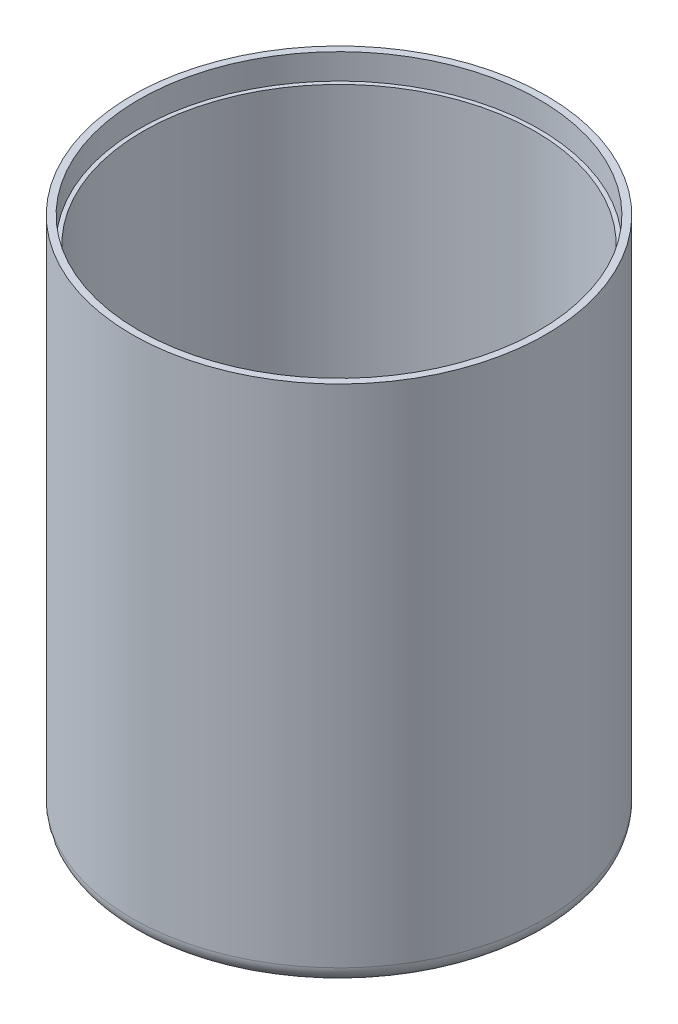
ISO-10303-21;
HEADER;
FILE_DESCRIPTION(('STEP AP214'),'2;1');
FILE_NAME('part.step','',(''),(''),'','','');
FILE_SCHEMA(('AUTOMOTIVE_DESIGN { 1 0 10303 214 1 1 1 1 }'));
ENDSEC;
DATA;
#1=APPLICATION_CONTEXT('core data for automotive mechanical design processes');
#2=APPLICATION_PROTOCOL_DEFINITION('international standard','automotive_design',2000,#1);
#3=PRODUCT_CONTEXT('',#1,'mechanical');
#4=PRODUCT('Part','Part','',(#3));
#5=PRODUCT_RELATED_PRODUCT_CATEGORY('part','',(#4));
#6=PRODUCT_DEFINITION_FORMATION('','',#4);
#7=PRODUCT_DEFINITION_CONTEXT('part definition',#1,'design');
#8=PRODUCT_DEFINITION('design','',#6,#7);
#9=PRODUCT_DEFINITION_SHAPE('','',#8);
#10=(LENGTH_UNIT() NAMED_UNIT(*) SI_UNIT(.MILLI.,.METRE.));
#11=(NAMED_UNIT(*) PLANE_ANGLE_UNIT() SI_UNIT($,.RADIAN.));
#12=(NAMED_UNIT(*) SI_UNIT($,.STERADIAN.) SOLID_ANGLE_UNIT());
#13=UNCERTAINTY_MEASURE_WITH_UNIT(LENGTH_MEASURE(1.E-05),#10,'distance_accuracy_value','');
#14=(GEOMETRIC_REPRESENTATION_CONTEXT(3) GLOBAL_UNCERTAINTY_ASSIGNED_CONTEXT((#13)) GLOBAL_UNIT_ASSIGNED_CONTEXT((#10,
#11,#12)) REPRESENTATION_CONTEXT('',''));
#15=CARTESIAN_POINT('',(0.,0.,0.));
#16=DIRECTION('',(0.,0.,1.));
#17=DIRECTION('',(1.,0.,0.));
#18=AXIS2_PLACEMENT_3D('',#15,#16,#17);
#19=CARTESIAN_POINT('',(0.,-2.28012519124318,0.));
#20=DIRECTION('',(0.,-1.,0.));
#21=DIRECTION('',(0.,0.,-1.));
#22=AXIS2_PLACEMENT_3D('',#19,#20,#21);
#23=CYLINDRICAL_SURFACE('',#22,11.55);
#24=CARTESIAN_POINT('',(0.,0.65,0.));
#25=DIRECTION('',(0.,-1.,0.));
#26=DIRECTION('',(0.,0.,-1.));
#27=AXIS2_PLACEMENT_3D('',#24,#25,#26);
#28=CIRCLE('',#27,11.55);
#29=CARTESIAN_POINT('',(0.,0.65,-11.55));
#30=VERTEX_POINT('',#29);
#31=EDGE_CURVE('E78',#30,#30,#28,.T.);
#32=ORIENTED_EDGE('',*,*,#31,.T.);
#33=EDGE_LOOP('',(#32));
#34=FACE_BOUND('',#33,.T.);
#35=CARTESIAN_POINT('',(0.,29.3,0.));
#36=DIRECTION('',(0.,1.,0.));
#37=DIRECTION('',(0.,0.,1.));
#38=AXIS2_PLACEMENT_3D('',#35,#36,#37);
#39=CIRCLE('',#38,11.55);
#40=CARTESIAN_POINT('',(0.,29.3,11.55));
#41=VERTEX_POINT('',#40);
#42=EDGE_CURVE('E54',#41,#41,#39,.F.);
#43=ORIENTED_EDGE('',*,*,#42,.F.);
#44=EDGE_LOOP('',(#43));
#45=FACE_BOUND('',#44,.T.);
#46=ADVANCED_FACE('F36',(#34,#45),#23,.F.);
#47=CARTESIAN_POINT('',(0.,-2.28012519124318,0.));
#48=DIRECTION('',(0.,-1.,0.));
#49=DIRECTION('',(0.,0.,-1.));
#50=AXIS2_PLACEMENT_3D('',#47,#48,#49);
#51=CYLINDRICAL_SURFACE('',#50,12.2);
#52=CARTESIAN_POINT('',(0.,1.,0.));
#53=DIRECTION('',(0.,-1.,0.));
#54=DIRECTION('',(0.,0.,-1.));
#55=AXIS2_PLACEMENT_3D('',#52,#53,#54);
#56=CIRCLE('',#55,12.2);
#57=CARTESIAN_POINT('',(0.,1.,-12.2));
#58=VERTEX_POINT('',#57);
#59=EDGE_CURVE('E10',#58,#58,#56,.F.);
#60=ORIENTED_EDGE('',*,*,#59,.T.);
#61=EDGE_LOOP('',(#60));
#62=FACE_BOUND('',#61,.T.);
#63=CARTESIAN_POINT('',(0.,30.8,0.));
#64=DIRECTION('',(0.,-1.,0.));
#65=DIRECTION('',(0.,0.,-1.));
#66=AXIS2_PLACEMENT_3D('',#63,#64,#65);
#67=CIRCLE('',#66,12.2);
#68=CARTESIAN_POINT('',(0.,30.8,-12.2));
#69=VERTEX_POINT('',#68);
#70=EDGE_CURVE('E81',#69,#69,#67,.T.);
#71=ORIENTED_EDGE('',*,*,#70,.T.);
#72=EDGE_LOOP('',(#71));
#73=FACE_BOUND('',#72,.T.);
#74=ADVANCED_FACE('F113',(#62,#73),#51,.T.);
#75=CARTESIAN_POINT('',(3.225,0.,0.));
#76=DIRECTION('',(0.,-1.,0.));
#77=DIRECTION('',(0.,0.,-1.));
#78=AXIS2_PLACEMENT_3D('',#75,#76,#77);
#79=PLANE('',#78);
#80=CARTESIAN_POINT('',(0.,0.,0.));
#81=DIRECTION('',(0.,-1.,0.));
#82=DIRECTION('',(0.,0.,-1.));
#83=AXIS2_PLACEMENT_3D('',#80,#81,#82);
#84=CIRCLE('',#83,11.2);
#85=CARTESIAN_POINT('',(0.,0.,-11.2));
#86=VERTEX_POINT('',#85);
#87=EDGE_CURVE('E43',#86,#86,#84,.T.);
#88=ORIENTED_EDGE('',*,*,#87,.T.);
#89=EDGE_LOOP('',(#88));
#90=FACE_BOUND('',#89,.T.);
#91=CARTESIAN_POINT('',(-8.5,0.,0.));
#92=DIRECTION('',(0.,-1.,0.));
#93=DIRECTION('',(0.,0.,-1.));
#94=AXIS2_PLACEMENT_3D('',#91,#92,#93);
#95=CIRCLE('',#94,1.24999999999999);
#96=CARTESIAN_POINT('',(-8.5,0.,-1.24999999999999));
#97=VERTEX_POINT('',#96);
#98=EDGE_CURVE('E57',#97,#97,#95,.T.);
#99=ORIENTED_EDGE('',*,*,#98,.F.);
#100=EDGE_LOOP('',(#99));
#101=FACE_BOUND('',#100,.T.);
#102=CARTESIAN_POINT('',(8.5,0.,0.));
#103=DIRECTION('',(0.,-1.,0.));
#104=DIRECTION('',(0.,0.,-1.));
#105=AXIS2_PLACEMENT_3D('',#102,#103,#104);
#106=CIRCLE('',#105,1.24999999999999);
#107=CARTESIAN_POINT('',(8.5,0.,-1.24999999999999));
#108=VERTEX_POINT('',#107);
#109=EDGE_CURVE('E62',#108,#108,#106,.T.);
#110=ORIENTED_EDGE('',*,*,#109,.F.);
#111=EDGE_LOOP('',(#110));
#112=FACE_BOUND('',#111,.T.);
#113=CARTESIAN_POINT('',(0.,0.,0.));
#114=DIRECTION('',(0.,-1.,0.));
#115=DIRECTION('',(0.,0.,-1.));
#116=AXIS2_PLACEMENT_3D('',#113,#114,#115);
#117=CIRCLE('',#116,3.225);
#118=CARTESIAN_POINT('',(0.,0.,-3.225));
#119=VERTEX_POINT('',#118);
#120=EDGE_CURVE('E51',#119,#119,#117,.T.);
#121=ORIENTED_EDGE('',*,*,#120,.F.);
#122=EDGE_LOOP('',(#121));
#123=FACE_BOUND('',#122,.T.);
#124=ADVANCED_FACE('F115',(#90,#101,#112,#123),#79,.T.);
#125=CARTESIAN_POINT('',(0.,-2.28012519124318,0.));
#126=DIRECTION('',(0.,-1.,0.));
#127=DIRECTION('',(0.,0.,-1.));
#128=AXIS2_PLACEMENT_3D('',#125,#126,#127);
#129=CYLINDRICAL_SURFACE('',#128,3.225);
#130=ORIENTED_EDGE('',*,*,#120,.T.);
#131=EDGE_LOOP('',(#130));
#132=FACE_BOUND('',#131,.T.);
#133=CARTESIAN_POINT('',(0.,-1.7,0.));
#134=DIRECTION('',(0.,-1.,0.));
#135=DIRECTION('',(0.,0.,-1.));
#136=AXIS2_PLACEMENT_3D('',#133,#134,#135);
#137=CIRCLE('',#136,3.225);
#138=CARTESIAN_POINT('',(0.,-1.7,-3.225));
#139=VERTEX_POINT('',#138);
#140=EDGE_CURVE('E69',#139,#139,#137,.T.);
#141=ORIENTED_EDGE('',*,*,#140,.F.);
#142=EDGE_LOOP('',(#141));
#143=FACE_BOUND('',#142,.T.);
#144=ADVANCED_FACE('F120',(#132,#143),#129,.T.);
#145=CARTESIAN_POINT('',(3.225,-1.7,0.));
#146=DIRECTION('',(0.,1.,0.));
#147=DIRECTION('',(0.,0.,1.));
#148=AXIS2_PLACEMENT_3D('',#145,#146,#147);
#149=PLANE('',#148);
#150=CARTESIAN_POINT('',(0.,-1.7,0.));
#151=DIRECTION('',(0.,-1.,0.));
#152=DIRECTION('',(0.,0.,-1.));
#153=AXIS2_PLACEMENT_3D('',#150,#151,#152);
#154=CIRCLE('',#153,2.575);
#155=CARTESIAN_POINT('',(0.,-1.7,-2.575));
#156=VERTEX_POINT('',#155);
#157=EDGE_CURVE('E72',#156,#156,#154,.T.);
#158=ORIENTED_EDGE('',*,*,#157,.F.);
#159=EDGE_LOOP('',(#158));
#160=FACE_BOUND('',#159,.T.);
#161=ORIENTED_EDGE('',*,*,#140,.T.);
#162=EDGE_LOOP('',(#161));
#163=FACE_BOUND('',#162,.T.);
#164=ADVANCED_FACE('F127',(#160,#163),#149,.F.);
#165=CARTESIAN_POINT('',(0.,-2.28012519124318,0.));
#166=DIRECTION('',(0.,-1.,0.));
#167=DIRECTION('',(0.,0.,-1.));
#168=AXIS2_PLACEMENT_3D('',#165,#166,#167);
#169=CYLINDRICAL_SURFACE('',#168,2.575);
#170=CARTESIAN_POINT('',(0.,0.65,0.));
#171=DIRECTION('',(0.,-1.,0.));
#172=DIRECTION('',(0.,0.,-1.));
#173=AXIS2_PLACEMENT_3D('',#170,#171,#172);
#174=CIRCLE('',#173,2.575);
#175=CARTESIAN_POINT('',(0.,0.65,-2.575));
#176=VERTEX_POINT('',#175);
#177=EDGE_CURVE('E75',#176,#176,#174,.T.);
#178=ORIENTED_EDGE('',*,*,#177,.F.);
#179=EDGE_LOOP('',(#178));
#180=FACE_BOUND('',#179,.T.);
#181=ORIENTED_EDGE('',*,*,#157,.T.);
#182=EDGE_LOOP('',(#181));
#183=FACE_BOUND('',#182,.T.);
#184=ADVANCED_FACE('F131',(#180,#183),#169,.F.);
#185=CARTESIAN_POINT('',(3.225,0.65,0.));
#186=DIRECTION('',(0.,-1.,0.));
#187=DIRECTION('',(0.,0.,-1.));
#188=AXIS2_PLACEMENT_3D('',#185,#186,#187);
#189=PLANE('',#188);
#190=CARTESIAN_POINT('',(8.5,0.65,0.));
#191=DIRECTION('',(0.,-1.,0.));
#192=DIRECTION('',(0.,0.,-1.));
#193=AXIS2_PLACEMENT_3D('',#190,#191,#192);
#194=CIRCLE('',#193,1.24999999999999);
#195=CARTESIAN_POINT('',(8.5,0.65,-1.24999999999999));
#196=VERTEX_POINT('',#195);
#197=EDGE_CURVE('E63',#196,#196,#194,.T.);
#198=ORIENTED_EDGE('',*,*,#197,.T.);
#199=EDGE_LOOP('',(#198));
#200=FACE_BOUND('',#199,.T.);
#201=CARTESIAN_POINT('',(-8.5,0.65,0.));
#202=DIRECTION('',(0.,-1.,0.));
#203=DIRECTION('',(0.,0.,-1.));
#204=AXIS2_PLACEMENT_3D('',#201,#202,#203);
#205=CIRCLE('',#204,1.43);
#206=CARTESIAN_POINT('',(-8.5,0.65,-1.43));
#207=VERTEX_POINT('',#206);
#208=EDGE_CURVE('E47',#207,#207,#205,.F.);
#209=ORIENTED_EDGE('',*,*,#208,.F.);
#210=EDGE_LOOP('',(#209));
#211=FACE_BOUND('',#210,.T.);
#212=ORIENTED_EDGE('',*,*,#31,.F.);
#213=EDGE_LOOP('',(#212));
#214=FACE_BOUND('',#213,.T.);
#215=ORIENTED_EDGE('',*,*,#177,.T.);
#216=EDGE_LOOP('',(#215));
#217=FACE_BOUND('',#216,.T.);
#218=ADVANCED_FACE('F109',(#200,#211,#214,#217),#189,.F.);
#219=CARTESIAN_POINT('',(11.55,30.8,0.));
#220=DIRECTION('',(0.,-1.,0.));
#221=DIRECTION('',(0.,0.,-1.));
#222=AXIS2_PLACEMENT_3D('',#219,#220,#221);
#223=PLANE('',#222);
#224=CARTESIAN_POINT('',(0.,30.8,0.));
#225=DIRECTION('',(0.,1.,0.));
#226=DIRECTION('',(0.,0.,1.));
#227=AXIS2_PLACEMENT_3D('',#224,#225,#226);
#228=CIRCLE('',#227,11.79);
#229=CARTESIAN_POINT('',(0.,30.8,11.79));
#230=VERTEX_POINT('',#229);
#231=EDGE_CURVE('E90',#230,#230,#228,.T.);
#232=ORIENTED_EDGE('',*,*,#231,.F.);
#233=EDGE_LOOP('',(#232));
#234=FACE_BOUND('',#233,.T.);
#235=ORIENTED_EDGE('',*,*,#70,.F.);
#236=EDGE_LOOP('',(#235));
#237=FACE_BOUND('',#236,.T.);
#238=ADVANCED_FACE('F105',(#234,#237),#223,.F.);
#239=CARTESIAN_POINT('',(-8.5,2.00713054722959,0.));
#240=DIRECTION('',(0.,1.,0.));
#241=DIRECTION('',(0.,0.,1.));
#242=AXIS2_PLACEMENT_3D('',#239,#240,#241);
#243=CYLINDRICAL_SURFACE('',#242,1.43);
#244=CARTESIAN_POINT('',(-8.5,1.05,0.));
#245=DIRECTION('',(0.,1.,0.));
#246=DIRECTION('',(0.,0.,1.));
#247=AXIS2_PLACEMENT_3D('',#244,#245,#246);
#248=CIRCLE('',#247,1.43);
#249=CARTESIAN_POINT('',(-8.5,1.05,1.43));
#250=VERTEX_POINT('',#249);
#251=EDGE_CURVE('E65',#250,#250,#248,.T.);
#252=ORIENTED_EDGE('',*,*,#251,.F.);
#253=EDGE_LOOP('',(#252));
#254=FACE_BOUND('',#253,.T.);
#255=ORIENTED_EDGE('',*,*,#208,.T.);
#256=EDGE_LOOP('',(#255));
#257=FACE_BOUND('',#256,.T.);
#258=ADVANCED_FACE('F108',(#254,#257),#243,.T.);
#259=CARTESIAN_POINT('',(-9.93,1.05,0.));
#260=DIRECTION('',(0.,-1.,0.));
#261=DIRECTION('',(0.,0.,-1.));
#262=AXIS2_PLACEMENT_3D('',#259,#260,#261);
#263=PLANE('',#262);
#264=CARTESIAN_POINT('',(-8.5,1.05,0.));
#265=DIRECTION('',(0.,-1.,0.));
#266=DIRECTION('',(0.,0.,-1.));
#267=AXIS2_PLACEMENT_3D('',#264,#265,#266);
#268=CIRCLE('',#267,1.24999999999999);
#269=CARTESIAN_POINT('',(-8.5,1.05,-1.24999999999999));
#270=VERTEX_POINT('',#269);
#271=EDGE_CURVE('E59',#270,#270,#268,.T.);
#272=ORIENTED_EDGE('',*,*,#271,.T.);
#273=EDGE_LOOP('',(#272));
#274=FACE_BOUND('',#273,.T.);
#275=ORIENTED_EDGE('',*,*,#251,.T.);
#276=EDGE_LOOP('',(#275));
#277=FACE_BOUND('',#276,.T.);
#278=ADVANCED_FACE('F141',(#274,#277),#263,.F.);
#279=CARTESIAN_POINT('',(8.5,0.,0.));
#280=DIRECTION('',(0.,-1.,0.));
#281=DIRECTION('',(0.,0.,-1.));
#282=AXIS2_PLACEMENT_3D('',#279,#280,#281);
#283=CYLINDRICAL_SURFACE('',#282,1.24999999999999);
#284=ORIENTED_EDGE('',*,*,#109,.T.);
#285=EDGE_LOOP('',(#284));
#286=FACE_BOUND('',#285,.T.);
#287=ORIENTED_EDGE('',*,*,#197,.F.);
#288=EDGE_LOOP('',(#287));
#289=FACE_BOUND('',#288,.T.);
#290=ADVANCED_FACE('F145',(#286,#289),#283,.F.);
#291=CARTESIAN_POINT('',(-8.5,0.,0.));
#292=DIRECTION('',(0.,-1.,0.));
#293=DIRECTION('',(0.,0.,-1.));
#294=AXIS2_PLACEMENT_3D('',#291,#292,#293);
#295=CYLINDRICAL_SURFACE('',#294,1.24999999999999);
#296=ORIENTED_EDGE('',*,*,#98,.T.);
#297=EDGE_LOOP('',(#296));
#298=FACE_BOUND('',#297,.T.);
#299=ORIENTED_EDGE('',*,*,#271,.F.);
#300=EDGE_LOOP('',(#299));
#301=FACE_BOUND('',#300,.T.);
#302=ADVANCED_FACE('F149',(#298,#301),#295,.F.);
#303=CARTESIAN_POINT('',(0.,29.3,0.));
#304=DIRECTION('',(0.,1.,0.));
#305=DIRECTION('',(0.,0.,1.));
#306=AXIS2_PLACEMENT_3D('',#303,#304,#305);
#307=PLANE('',#306);
#308=CARTESIAN_POINT('',(0.,29.3,0.));
#309=DIRECTION('',(0.,1.,0.));
#310=DIRECTION('',(0.,0.,1.));
#311=AXIS2_PLACEMENT_3D('',#308,#309,#310);
#312=CIRCLE('',#311,11.79);
#313=CARTESIAN_POINT('',(0.,29.3,11.79));
#314=VERTEX_POINT('',#313);
#315=EDGE_CURVE('E58',#314,#314,#312,.T.);
#316=ORIENTED_EDGE('',*,*,#315,.T.);
#317=EDGE_LOOP('',(#316));
#318=FACE_BOUND('',#317,.T.);
#319=ORIENTED_EDGE('',*,*,#42,.T.);
#320=EDGE_LOOP('',(#319));
#321=FACE_BOUND('',#320,.T.);
#322=ADVANCED_FACE('F96',(#318,#321),#307,.T.);
#323=CARTESIAN_POINT('',(0.,29.3,0.));
#324=DIRECTION('',(0.,1.,0.));
#325=DIRECTION('',(0.,0.,1.));
#326=AXIS2_PLACEMENT_3D('',#323,#324,#325);
#327=CYLINDRICAL_SURFACE('',#326,11.79);
#328=ORIENTED_EDGE('',*,*,#315,.F.);
#329=EDGE_LOOP('',(#328));
#330=FACE_BOUND('',#329,.T.);
#331=ORIENTED_EDGE('',*,*,#231,.T.);
#332=EDGE_LOOP('',(#331));
#333=FACE_BOUND('',#332,.T.);
#334=ADVANCED_FACE('F99',(#330,#333),#327,.F.);
#335=CARTESIAN_POINT('',(0.,1.,0.));
#336=DIRECTION('',(0.,-1.,0.));
#337=DIRECTION('',(0.,0.,-1.));
#338=AXIS2_PLACEMENT_3D('',#335,#336,#337);
#339=TOROIDAL_SURFACE('',#338,11.2,1.);
#340=ORIENTED_EDGE('',*,*,#59,.F.);
#341=EDGE_LOOP('',(#340));
#342=FACE_BOUND('',#341,.T.);
#343=ORIENTED_EDGE('',*,*,#87,.F.);
#344=EDGE_LOOP('',(#343));
#345=FACE_BOUND('',#344,.T.);
#346=ADVANCED_FACE('F38',(#342,#345),#339,.T.);
#347=CLOSED_SHELL('',(#46,#74,#124,#144,#164,#184,#218,#238,#258,#278,#290,#302,#322,#334,#346));
#348=MANIFOLD_SOLID_BREP('B2',#347);
#349=ADVANCED_BREP_SHAPE_REPRESENTATION('',(#18,#348),#14);
#350=SHAPE_DEFINITION_REPRESENTATION(#9,#349);
ENDSEC;
END-ISO-10303-21;
